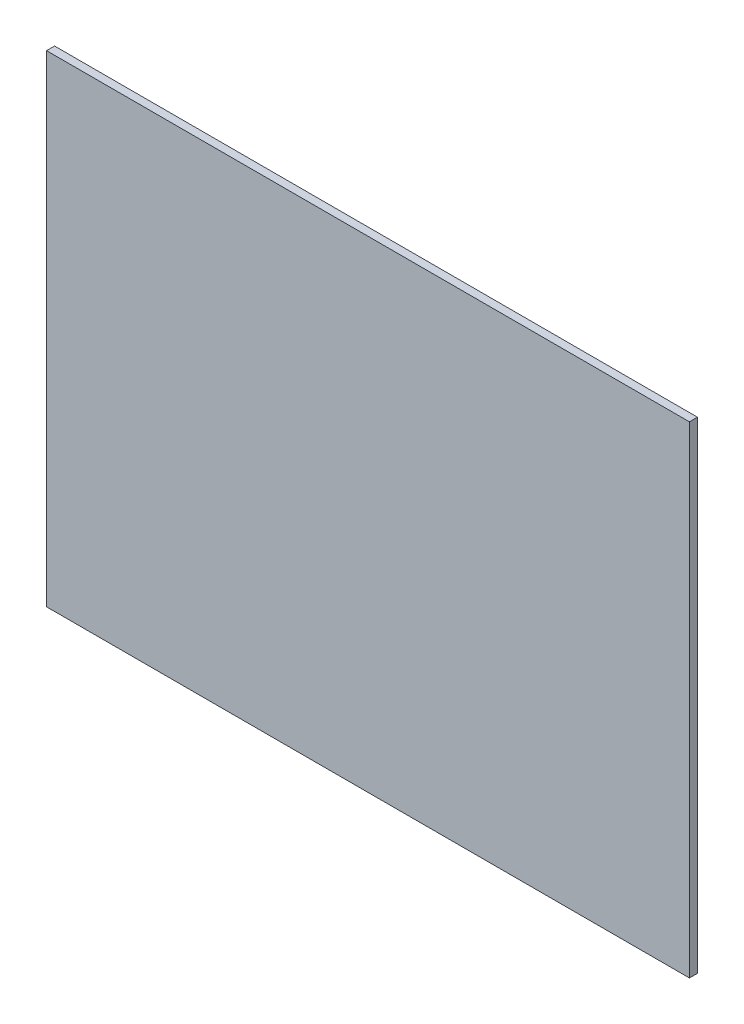
ISO-10303-21;
HEADER;
FILE_DESCRIPTION(('STEP AP214'),'2;1');
FILE_NAME('part.step','',(''),(''),'','','');
FILE_SCHEMA(('AUTOMOTIVE_DESIGN { 1 0 10303 214 1 1 1 1 }'));
ENDSEC;
DATA;
#1=APPLICATION_CONTEXT('core data for automotive mechanical design processes');
#2=APPLICATION_PROTOCOL_DEFINITION('international standard','automotive_design',2000,#1);
#3=PRODUCT_CONTEXT('',#1,'mechanical');
#4=PRODUCT('Part','Part','',(#3));
#5=PRODUCT_RELATED_PRODUCT_CATEGORY('part','',(#4));
#6=PRODUCT_DEFINITION_FORMATION('','',#4);
#7=PRODUCT_DEFINITION_CONTEXT('part definition',#1,'design');
#8=PRODUCT_DEFINITION('design','',#6,#7);
#9=PRODUCT_DEFINITION_SHAPE('','',#8);
#10=(LENGTH_UNIT() NAMED_UNIT(*) SI_UNIT(.MILLI.,.METRE.));
#11=(NAMED_UNIT(*) PLANE_ANGLE_UNIT() SI_UNIT($,.RADIAN.));
#12=(NAMED_UNIT(*) SI_UNIT($,.STERADIAN.) SOLID_ANGLE_UNIT());
#13=UNCERTAINTY_MEASURE_WITH_UNIT(LENGTH_MEASURE(1.E-05),#10,'distance_accuracy_value','');
#14=(GEOMETRIC_REPRESENTATION_CONTEXT(3) GLOBAL_UNCERTAINTY_ASSIGNED_CONTEXT((#13)) GLOBAL_UNIT_ASSIGNED_CONTEXT((#10,
#11,#12)) REPRESENTATION_CONTEXT('',''));
#15=CARTESIAN_POINT('',(0.,0.,0.));
#16=DIRECTION('',(0.,0.,1.));
#17=DIRECTION('',(1.,0.,0.));
#18=AXIS2_PLACEMENT_3D('',#15,#16,#17);
#19=CARTESIAN_POINT('',(0.40005,-0.29972,0.));
#20=DIRECTION('',(-1.,0.,0.));
#21=DIRECTION('',(0.,1.,0.));
#22=AXIS2_PLACEMENT_3D('',#19,#20,#21);
#23=PLANE('',#22);
#24=DIRECTION('',(0.,1.,0.));
#25=VECTOR('',#24,1.);
#26=CARTESIAN_POINT('',(0.40005,-0.29972,0.));
#27=LINE('',#26,#25);
#28=CARTESIAN_POINT('',(0.40005,-0.29972,0.));
#29=VERTEX_POINT('',#28);
#30=CARTESIAN_POINT('',(0.40005,0.29972,0.));
#31=VERTEX_POINT('',#30);
#32=EDGE_CURVE('E11',#29,#31,#27,.T.);
#33=ORIENTED_EDGE('',*,*,#32,.T.);
#34=DIRECTION('',(0.,0.,1.));
#35=VECTOR('',#34,1.);
#36=CARTESIAN_POINT('',(0.40005,0.29972,0.));
#37=LINE('',#36,#35);
#38=CARTESIAN_POINT('',(0.40005,0.29972,0.00999998));
#39=VERTEX_POINT('',#38);
#40=EDGE_CURVE('E25',#31,#39,#37,.T.);
#41=ORIENTED_EDGE('',*,*,#40,.T.);
#42=DIRECTION('',(0.,1.,0.));
#43=VECTOR('',#42,1.);
#44=CARTESIAN_POINT('',(0.40005,-0.29972,0.00999998));
#45=LINE('',#44,#43);
#46=CARTESIAN_POINT('',(0.40005,-0.29972,0.00999998));
#47=VERTEX_POINT('',#46);
#48=EDGE_CURVE('E96',#47,#39,#45,.T.);
#49=ORIENTED_EDGE('',*,*,#48,.F.);
#50=DIRECTION('',(0.,0.,1.));
#51=VECTOR('',#50,1.);
#52=CARTESIAN_POINT('',(0.40005,-0.29972,0.));
#53=LINE('',#52,#51);
#54=EDGE_CURVE('E91',#29,#47,#53,.T.);
#55=ORIENTED_EDGE('',*,*,#54,.F.);
#56=EDGE_LOOP('',(#33,#41,#49,#55));
#57=FACE_BOUND('',#56,.T.);
#58=ADVANCED_FACE('F17',(#57),#23,.F.);
#59=CARTESIAN_POINT('',(-0.40005,-0.29972,0.));
#60=DIRECTION('',(0.,1.,0.));
#61=DIRECTION('',(1.,0.,0.));
#62=AXIS2_PLACEMENT_3D('',#59,#60,#61);
#63=PLANE('',#62);
#64=DIRECTION('',(1.,0.,0.));
#65=VECTOR('',#64,1.);
#66=CARTESIAN_POINT('',(-0.40005,-0.29972,0.));
#67=LINE('',#66,#65);
#68=CARTESIAN_POINT('',(-0.40005,-0.29972,0.));
#69=VERTEX_POINT('',#68);
#70=EDGE_CURVE('E73',#69,#29,#67,.T.);
#71=ORIENTED_EDGE('',*,*,#70,.T.);
#72=ORIENTED_EDGE('',*,*,#54,.T.);
#73=DIRECTION('',(1.,0.,0.));
#74=VECTOR('',#73,1.);
#75=CARTESIAN_POINT('',(-0.40005,-0.29972,0.00999998));
#76=LINE('',#75,#74);
#77=CARTESIAN_POINT('',(-0.40005,-0.29972,0.00999998));
#78=VERTEX_POINT('',#77);
#79=EDGE_CURVE('E76',#78,#47,#76,.T.);
#80=ORIENTED_EDGE('',*,*,#79,.F.);
#81=DIRECTION('',(0.,0.,1.));
#82=VECTOR('',#81,1.);
#83=CARTESIAN_POINT('',(-0.40005,-0.29972,0.));
#84=LINE('',#83,#82);
#85=EDGE_CURVE('E74',#69,#78,#84,.T.);
#86=ORIENTED_EDGE('',*,*,#85,.F.);
#87=EDGE_LOOP('',(#71,#72,#80,#86));
#88=FACE_BOUND('',#87,.T.);
#89=ADVANCED_FACE('F108',(#88),#63,.F.);
#90=CARTESIAN_POINT('',(-0.40005,0.29972,0.));
#91=DIRECTION('',(1.,0.,0.));
#92=DIRECTION('',(0.,-1.,0.));
#93=AXIS2_PLACEMENT_3D('',#90,#91,#92);
#94=PLANE('',#93);
#95=DIRECTION('',(0.,-1.,0.));
#96=VECTOR('',#95,1.);
#97=CARTESIAN_POINT('',(-0.40005,0.29972,0.));
#98=LINE('',#97,#96);
#99=CARTESIAN_POINT('',(-0.40005,0.29972,0.));
#100=VERTEX_POINT('',#99);
#101=EDGE_CURVE('E59',#100,#69,#98,.T.);
#102=ORIENTED_EDGE('',*,*,#101,.T.);
#103=ORIENTED_EDGE('',*,*,#85,.T.);
#104=DIRECTION('',(0.,-1.,0.));
#105=VECTOR('',#104,1.);
#106=CARTESIAN_POINT('',(-0.40005,0.29972,0.00999998));
#107=LINE('',#106,#105);
#108=CARTESIAN_POINT('',(-0.40005,0.29972,0.00999998));
#109=VERTEX_POINT('',#108);
#110=EDGE_CURVE('E62',#109,#78,#107,.T.);
#111=ORIENTED_EDGE('',*,*,#110,.F.);
#112=DIRECTION('',(0.,0.,1.));
#113=VECTOR('',#112,1.);
#114=CARTESIAN_POINT('',(-0.40005,0.29972,0.));
#115=LINE('',#114,#113);
#116=EDGE_CURVE('E54',#100,#109,#115,.T.);
#117=ORIENTED_EDGE('',*,*,#116,.F.);
#118=EDGE_LOOP('',(#102,#103,#111,#117));
#119=FACE_BOUND('',#118,.T.);
#120=ADVANCED_FACE('F56',(#119),#94,.F.);
#121=CARTESIAN_POINT('',(0.40005,0.29972,0.));
#122=DIRECTION('',(0.,-1.,0.));
#123=DIRECTION('',(-1.,0.,0.));
#124=AXIS2_PLACEMENT_3D('',#121,#122,#123);
#125=PLANE('',#124);
#126=DIRECTION('',(-1.,0.,0.));
#127=VECTOR('',#126,1.);
#128=CARTESIAN_POINT('',(0.40005,0.29972,0.));
#129=LINE('',#128,#127);
#130=EDGE_CURVE('E65',#31,#100,#129,.T.);
#131=ORIENTED_EDGE('',*,*,#130,.T.);
#132=ORIENTED_EDGE('',*,*,#116,.T.);
#133=DIRECTION('',(-1.,0.,0.));
#134=VECTOR('',#133,1.);
#135=CARTESIAN_POINT('',(0.40005,0.29972,0.00999998));
#136=LINE('',#135,#134);
#137=EDGE_CURVE('E69',#39,#109,#136,.T.);
#138=ORIENTED_EDGE('',*,*,#137,.F.);
#139=ORIENTED_EDGE('',*,*,#40,.F.);
#140=EDGE_LOOP('',(#131,#132,#138,#139));
#141=FACE_BOUND('',#140,.T.);
#142=ADVANCED_FACE('F67',(#141),#125,.F.);
#143=CARTESIAN_POINT('',(0.,0.,0.00999998));
#144=DIRECTION('',(0.,0.,1.));
#145=DIRECTION('',(1.,0.,0.));
#146=AXIS2_PLACEMENT_3D('',#143,#144,#145);
#147=PLANE('',#146);
#148=ORIENTED_EDGE('',*,*,#48,.T.);
#149=ORIENTED_EDGE('',*,*,#137,.T.);
#150=ORIENTED_EDGE('',*,*,#110,.T.);
#151=ORIENTED_EDGE('',*,*,#79,.T.);
#152=EDGE_LOOP('',(#148,#149,#150,#151));
#153=FACE_BOUND('',#152,.T.);
#154=ADVANCED_FACE('F106',(#153),#147,.T.);
#155=CARTESIAN_POINT('',(0.,0.,0.));
#156=DIRECTION('',(0.,0.,1.));
#157=DIRECTION('',(1.,0.,0.));
#158=AXIS2_PLACEMENT_3D('',#155,#156,#157);
#159=PLANE('',#158);
#160=ORIENTED_EDGE('',*,*,#70,.F.);
#161=ORIENTED_EDGE('',*,*,#101,.F.);
#162=ORIENTED_EDGE('',*,*,#130,.F.);
#163=ORIENTED_EDGE('',*,*,#32,.F.);
#164=EDGE_LOOP('',(#160,#161,#162,#163));
#165=FACE_BOUND('',#164,.T.);
#166=ADVANCED_FACE('F71',(#165),#159,.F.);
#167=CLOSED_SHELL('',(#58,#89,#120,#142,#154,#166));
#168=MANIFOLD_SOLID_BREP('B1',#167);
#169=ADVANCED_BREP_SHAPE_REPRESENTATION('',(#18,#168),#14);
#170=SHAPE_DEFINITION_REPRESENTATION(#9,#169);
ENDSEC;
END-ISO-10303-21;
